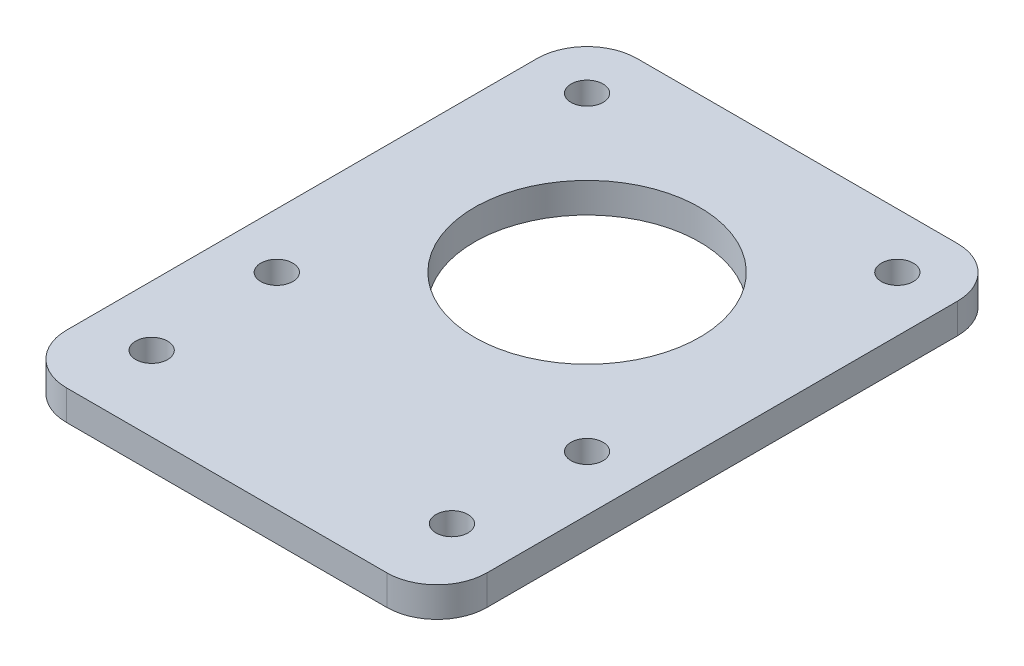
ISO-10303-21;
HEADER;
FILE_DESCRIPTION(('STEP AP214'),'2;1');
FILE_NAME('part.step','',(''),(''),'','','');
FILE_SCHEMA(('AUTOMOTIVE_DESIGN { 1 0 10303 214 1 1 1 1 }'));
ENDSEC;
DATA;
#1=APPLICATION_CONTEXT('core data for automotive mechanical design processes');
#2=APPLICATION_PROTOCOL_DEFINITION('international standard','automotive_design',2000,#1);
#3=PRODUCT_CONTEXT('',#1,'mechanical');
#4=PRODUCT('Part','Part','',(#3));
#5=PRODUCT_RELATED_PRODUCT_CATEGORY('part','',(#4));
#6=PRODUCT_DEFINITION_FORMATION('','',#4);
#7=PRODUCT_DEFINITION_CONTEXT('part definition',#1,'design');
#8=PRODUCT_DEFINITION('design','',#6,#7);
#9=PRODUCT_DEFINITION_SHAPE('','',#8);
#10=(LENGTH_UNIT() NAMED_UNIT(*) SI_UNIT(.MILLI.,.METRE.));
#11=(NAMED_UNIT(*) PLANE_ANGLE_UNIT() SI_UNIT($,.RADIAN.));
#12=(NAMED_UNIT(*) SI_UNIT($,.STERADIAN.) SOLID_ANGLE_UNIT());
#13=UNCERTAINTY_MEASURE_WITH_UNIT(LENGTH_MEASURE(1.E-05),#10,'distance_accuracy_value','');
#14=(GEOMETRIC_REPRESENTATION_CONTEXT(3) GLOBAL_UNCERTAINTY_ASSIGNED_CONTEXT((#13)) GLOBAL_UNIT_ASSIGNED_CONTEXT((#10,
#11,#12)) REPRESENTATION_CONTEXT('',''));
#15=CARTESIAN_POINT('',(0.,0.,0.));
#16=DIRECTION('',(0.,0.,1.));
#17=DIRECTION('',(1.,0.,0.));
#18=AXIS2_PLACEMENT_3D('',#15,#16,#17);
#19=CARTESIAN_POINT('',(0.,3.,0.));
#20=DIRECTION('',(0.,-1.,0.));
#21=DIRECTION('',(0.,0.,-1.));
#22=AXIS2_PLACEMENT_3D('',#19,#20,#21);
#23=PLANE('',#22);
#24=DIRECTION('',(-1.,0.,0.));
#25=VECTOR('',#24,1.);
#26=CARTESIAN_POINT('',(0.,3.,-57.));
#27=LINE('',#26,#25);
#28=CARTESIAN_POINT('',(37.,3.,-57.));
#29=VERTEX_POINT('',#28);
#30=CARTESIAN_POINT('',(5.,3.,-57.));
#31=VERTEX_POINT('',#30);
#32=EDGE_CURVE('E146',#29,#31,#27,.T.);
#33=ORIENTED_EDGE('',*,*,#32,.T.);
#34=CARTESIAN_POINT('',(5.,3.,-52.));
#35=DIRECTION('',(0.,-1.,0.));
#36=DIRECTION('',(0.,0.,-1.));
#37=AXIS2_PLACEMENT_3D('',#34,#35,#36);
#38=CIRCLE('',#37,5.);
#39=CARTESIAN_POINT('',(0.,3.,-52.));
#40=VERTEX_POINT('',#39);
#41=EDGE_CURVE('E164',#31,#40,#38,.F.);
#42=ORIENTED_EDGE('',*,*,#41,.T.);
#43=DIRECTION('',(0.,0.,1.));
#44=VECTOR('',#43,1.);
#45=CARTESIAN_POINT('',(0.,3.,0.));
#46=LINE('',#45,#44);
#47=CARTESIAN_POINT('',(0.,3.,-5.));
#48=VERTEX_POINT('',#47);
#49=EDGE_CURVE('E128',#40,#48,#46,.T.);
#50=ORIENTED_EDGE('',*,*,#49,.T.);
#51=CARTESIAN_POINT('',(5.,3.,-5.));
#52=DIRECTION('',(0.,-1.,0.));
#53=DIRECTION('',(0.,0.,-1.));
#54=AXIS2_PLACEMENT_3D('',#51,#52,#53);
#55=CIRCLE('',#54,5.);
#56=CARTESIAN_POINT('',(5.,3.,0.));
#57=VERTEX_POINT('',#56);
#58=EDGE_CURVE('E160',#48,#57,#55,.F.);
#59=ORIENTED_EDGE('',*,*,#58,.T.);
#60=DIRECTION('',(1.,0.,0.));
#61=VECTOR('',#60,1.);
#62=CARTESIAN_POINT('',(0.,3.,0.));
#63=LINE('',#62,#61);
#64=CARTESIAN_POINT('',(37.,3.,0.));
#65=VERTEX_POINT('',#64);
#66=EDGE_CURVE('E173',#57,#65,#63,.T.);
#67=ORIENTED_EDGE('',*,*,#66,.T.);
#68=CARTESIAN_POINT('',(37.,3.,-5.));
#69=DIRECTION('',(0.,-1.,0.));
#70=DIRECTION('',(0.,0.,-1.));
#71=AXIS2_PLACEMENT_3D('',#68,#69,#70);
#72=CIRCLE('',#71,5.);
#73=CARTESIAN_POINT('',(42.,3.,-5.));
#74=VERTEX_POINT('',#73);
#75=EDGE_CURVE('E63',#65,#74,#72,.F.);
#76=ORIENTED_EDGE('',*,*,#75,.T.);
#77=DIRECTION('',(0.,0.,-1.));
#78=VECTOR('',#77,1.);
#79=CARTESIAN_POINT('',(42.,3.,0.));
#80=LINE('',#79,#78);
#81=CARTESIAN_POINT('',(42.,3.,-52.));
#82=VERTEX_POINT('',#81);
#83=EDGE_CURVE('E179',#74,#82,#80,.T.);
#84=ORIENTED_EDGE('',*,*,#83,.T.);
#85=CARTESIAN_POINT('',(37.,3.,-52.));
#86=DIRECTION('',(0.,-1.,0.));
#87=DIRECTION('',(0.,0.,-1.));
#88=AXIS2_PLACEMENT_3D('',#85,#86,#87);
#89=CIRCLE('',#88,5.);
#90=EDGE_CURVE('E162',#82,#29,#89,.F.);
#91=ORIENTED_EDGE('',*,*,#90,.T.);
#92=EDGE_LOOP('',(#33,#42,#50,#59,#67,#76,#84,#91));
#93=FACE_BOUND('',#92,.T.);
#94=CARTESIAN_POINT('',(36.5,3.,-51.5));
#95=DIRECTION('',(0.,1.,0.));
#96=DIRECTION('',(0.,0.,1.));
#97=AXIS2_PLACEMENT_3D('',#94,#95,#96);
#98=CIRCLE('',#97,1.6);
#99=CARTESIAN_POINT('',(36.5,3.,-49.9));
#100=VERTEX_POINT('',#99);
#101=EDGE_CURVE('E137',#100,#100,#98,.T.);
#102=ORIENTED_EDGE('',*,*,#101,.F.);
#103=EDGE_LOOP('',(#102));
#104=FACE_BOUND('',#103,.T.);
#105=CARTESIAN_POINT('',(5.5,3.,-51.5));
#106=DIRECTION('',(0.,1.,0.));
#107=DIRECTION('',(0.,0.,1.));
#108=AXIS2_PLACEMENT_3D('',#105,#106,#107);
#109=CIRCLE('',#108,1.6);
#110=CARTESIAN_POINT('',(5.5,3.,-49.9));
#111=VERTEX_POINT('',#110);
#112=EDGE_CURVE('E194',#111,#111,#109,.T.);
#113=ORIENTED_EDGE('',*,*,#112,.F.);
#114=EDGE_LOOP('',(#113));
#115=FACE_BOUND('',#114,.T.);
#116=CARTESIAN_POINT('',(5.5,3.,-20.5));
#117=DIRECTION('',(0.,1.,0.));
#118=DIRECTION('',(0.,0.,1.));
#119=AXIS2_PLACEMENT_3D('',#116,#117,#118);
#120=CIRCLE('',#119,1.6);
#121=CARTESIAN_POINT('',(5.5,3.,-18.9));
#122=VERTEX_POINT('',#121);
#123=EDGE_CURVE('E199',#122,#122,#120,.T.);
#124=ORIENTED_EDGE('',*,*,#123,.F.);
#125=EDGE_LOOP('',(#124));
#126=FACE_BOUND('',#125,.T.);
#127=CARTESIAN_POINT('',(36.5,3.,-20.5));
#128=DIRECTION('',(0.,1.,0.));
#129=DIRECTION('',(0.,0.,1.));
#130=AXIS2_PLACEMENT_3D('',#127,#128,#129);
#131=CIRCLE('',#130,1.6);
#132=CARTESIAN_POINT('',(36.5,3.,-18.9));
#133=VERTEX_POINT('',#132);
#134=EDGE_CURVE('E205',#133,#133,#131,.T.);
#135=ORIENTED_EDGE('',*,*,#134,.F.);
#136=EDGE_LOOP('',(#135));
#137=FACE_BOUND('',#136,.T.);
#138=CARTESIAN_POINT('',(6.,3.,-7.49999999999999));
#139=DIRECTION('',(0.,1.,0.));
#140=DIRECTION('',(0.,0.,1.));
#141=AXIS2_PLACEMENT_3D('',#138,#139,#140);
#142=CIRCLE('',#141,1.6);
#143=CARTESIAN_POINT('',(6.,3.,-5.9));
#144=VERTEX_POINT('',#143);
#145=EDGE_CURVE('E211',#144,#144,#142,.T.);
#146=ORIENTED_EDGE('',*,*,#145,.F.);
#147=EDGE_LOOP('',(#146));
#148=FACE_BOUND('',#147,.T.);
#149=CARTESIAN_POINT('',(36.,3.,-7.49999999999999));
#150=DIRECTION('',(0.,1.,0.));
#151=DIRECTION('',(0.,0.,1.));
#152=AXIS2_PLACEMENT_3D('',#149,#150,#151);
#153=CIRCLE('',#152,1.6);
#154=CARTESIAN_POINT('',(36.,3.,-5.9));
#155=VERTEX_POINT('',#154);
#156=EDGE_CURVE('E217',#155,#155,#153,.T.);
#157=ORIENTED_EDGE('',*,*,#156,.F.);
#158=EDGE_LOOP('',(#157));
#159=FACE_BOUND('',#158,.T.);
#160=CARTESIAN_POINT('',(21.,3.,-36.));
#161=DIRECTION('',(0.,1.,0.));
#162=DIRECTION('',(0.,0.,1.));
#163=AXIS2_PLACEMENT_3D('',#160,#161,#162);
#164=CIRCLE('',#163,11.25);
#165=CARTESIAN_POINT('',(21.,3.,-24.75));
#166=VERTEX_POINT('',#165);
#167=EDGE_CURVE('E223',#166,#166,#164,.T.);
#168=ORIENTED_EDGE('',*,*,#167,.F.);
#169=EDGE_LOOP('',(#168));
#170=FACE_BOUND('',#169,.T.);
#171=ADVANCED_FACE('F41',(#93,#104,#115,#126,#137,#148,#159,#170),#23,.F.);
#172=CARTESIAN_POINT('',(0.,0.,0.));
#173=DIRECTION('',(0.,-1.,0.));
#174=DIRECTION('',(0.,0.,-1.));
#175=AXIS2_PLACEMENT_3D('',#172,#173,#174);
#176=PLANE('',#175);
#177=CARTESIAN_POINT('',(36.,0.,-7.49999999999999));
#178=DIRECTION('',(0.,1.,0.));
#179=DIRECTION('',(0.,0.,1.));
#180=AXIS2_PLACEMENT_3D('',#177,#178,#179);
#181=CIRCLE('',#180,1.6);
#182=CARTESIAN_POINT('',(36.,0.,-5.9));
#183=VERTEX_POINT('',#182);
#184=EDGE_CURVE('E220',#183,#183,#181,.T.);
#185=ORIENTED_EDGE('',*,*,#184,.T.);
#186=EDGE_LOOP('',(#185));
#187=FACE_BOUND('',#186,.T.);
#188=CARTESIAN_POINT('',(36.5,0.,-20.5));
#189=DIRECTION('',(0.,1.,0.));
#190=DIRECTION('',(0.,0.,1.));
#191=AXIS2_PLACEMENT_3D('',#188,#189,#190);
#192=CIRCLE('',#191,1.6);
#193=CARTESIAN_POINT('',(36.5,0.,-18.9));
#194=VERTEX_POINT('',#193);
#195=EDGE_CURVE('E208',#194,#194,#192,.T.);
#196=ORIENTED_EDGE('',*,*,#195,.T.);
#197=EDGE_LOOP('',(#196));
#198=FACE_BOUND('',#197,.T.);
#199=CARTESIAN_POINT('',(5.5,0.,-51.5));
#200=DIRECTION('',(0.,1.,0.));
#201=DIRECTION('',(0.,0.,1.));
#202=AXIS2_PLACEMENT_3D('',#199,#200,#201);
#203=CIRCLE('',#202,1.6);
#204=CARTESIAN_POINT('',(5.5,0.,-49.9));
#205=VERTEX_POINT('',#204);
#206=EDGE_CURVE('E196',#205,#205,#203,.T.);
#207=ORIENTED_EDGE('',*,*,#206,.T.);
#208=EDGE_LOOP('',(#207));
#209=FACE_BOUND('',#208,.T.);
#210=DIRECTION('',(0.,0.,1.));
#211=VECTOR('',#210,1.);
#212=CARTESIAN_POINT('',(0.,0.,0.));
#213=LINE('',#212,#211);
#214=CARTESIAN_POINT('',(0.,0.,-52.));
#215=VERTEX_POINT('',#214);
#216=CARTESIAN_POINT('',(0.,0.,-5.));
#217=VERTEX_POINT('',#216);
#218=EDGE_CURVE('E125',#215,#217,#213,.T.);
#219=ORIENTED_EDGE('',*,*,#218,.F.);
#220=CARTESIAN_POINT('',(5.,0.,-52.));
#221=DIRECTION('',(0.,-1.,0.));
#222=DIRECTION('',(0.,0.,-1.));
#223=AXIS2_PLACEMENT_3D('',#220,#221,#222);
#224=CIRCLE('',#223,5.);
#225=CARTESIAN_POINT('',(5.,0.,-57.));
#226=VERTEX_POINT('',#225);
#227=EDGE_CURVE('E108',#215,#226,#224,.T.);
#228=ORIENTED_EDGE('',*,*,#227,.T.);
#229=DIRECTION('',(-1.,0.,0.));
#230=VECTOR('',#229,1.);
#231=CARTESIAN_POINT('',(0.,0.,-57.));
#232=LINE('',#231,#230);
#233=CARTESIAN_POINT('',(37.,0.,-57.));
#234=VERTEX_POINT('',#233);
#235=EDGE_CURVE('E150',#234,#226,#232,.T.);
#236=ORIENTED_EDGE('',*,*,#235,.F.);
#237=CARTESIAN_POINT('',(37.,0.,-52.));
#238=DIRECTION('',(0.,-1.,0.));
#239=DIRECTION('',(0.,0.,-1.));
#240=AXIS2_PLACEMENT_3D('',#237,#238,#239);
#241=CIRCLE('',#240,5.);
#242=CARTESIAN_POINT('',(42.,0.,-52.));
#243=VERTEX_POINT('',#242);
#244=EDGE_CURVE('E119',#234,#243,#241,.T.);
#245=ORIENTED_EDGE('',*,*,#244,.T.);
#246=DIRECTION('',(0.,0.,-1.));
#247=VECTOR('',#246,1.);
#248=CARTESIAN_POINT('',(42.,0.,0.));
#249=LINE('',#248,#247);
#250=CARTESIAN_POINT('',(42.,0.,-5.));
#251=VERTEX_POINT('',#250);
#252=EDGE_CURVE('E140',#251,#243,#249,.T.);
#253=ORIENTED_EDGE('',*,*,#252,.F.);
#254=CARTESIAN_POINT('',(37.,0.,-5.));
#255=DIRECTION('',(0.,-1.,0.));
#256=DIRECTION('',(0.,0.,-1.));
#257=AXIS2_PLACEMENT_3D('',#254,#255,#256);
#258=CIRCLE('',#257,5.);
#259=CARTESIAN_POINT('',(37.,0.,0.));
#260=VERTEX_POINT('',#259);
#261=EDGE_CURVE('E129',#251,#260,#258,.T.);
#262=ORIENTED_EDGE('',*,*,#261,.T.);
#263=DIRECTION('',(1.,0.,0.));
#264=VECTOR('',#263,1.);
#265=CARTESIAN_POINT('',(0.,0.,0.));
#266=LINE('',#265,#264);
#267=CARTESIAN_POINT('',(5.,0.,0.));
#268=VERTEX_POINT('',#267);
#269=EDGE_CURVE('E136',#268,#260,#266,.T.);
#270=ORIENTED_EDGE('',*,*,#269,.F.);
#271=CARTESIAN_POINT('',(5.,0.,-5.));
#272=DIRECTION('',(0.,-1.,0.));
#273=DIRECTION('',(0.,0.,-1.));
#274=AXIS2_PLACEMENT_3D('',#271,#272,#273);
#275=CIRCLE('',#274,5.);
#276=EDGE_CURVE('E135',#268,#217,#275,.T.);
#277=ORIENTED_EDGE('',*,*,#276,.T.);
#278=EDGE_LOOP('',(#219,#228,#236,#245,#253,#262,#270,#277));
#279=FACE_BOUND('',#278,.T.);
#280=CARTESIAN_POINT('',(36.5,0.,-51.5));
#281=DIRECTION('',(0.,1.,0.));
#282=DIRECTION('',(0.,0.,1.));
#283=AXIS2_PLACEMENT_3D('',#280,#281,#282);
#284=CIRCLE('',#283,1.6);
#285=CARTESIAN_POINT('',(36.5,0.,-49.9));
#286=VERTEX_POINT('',#285);
#287=EDGE_CURVE('E143',#286,#286,#284,.T.);
#288=ORIENTED_EDGE('',*,*,#287,.T.);
#289=EDGE_LOOP('',(#288));
#290=FACE_BOUND('',#289,.T.);
#291=CARTESIAN_POINT('',(5.5,0.,-20.5));
#292=DIRECTION('',(0.,1.,0.));
#293=DIRECTION('',(0.,0.,1.));
#294=AXIS2_PLACEMENT_3D('',#291,#292,#293);
#295=CIRCLE('',#294,1.6);
#296=CARTESIAN_POINT('',(5.5,0.,-18.9));
#297=VERTEX_POINT('',#296);
#298=EDGE_CURVE('E202',#297,#297,#295,.T.);
#299=ORIENTED_EDGE('',*,*,#298,.T.);
#300=EDGE_LOOP('',(#299));
#301=FACE_BOUND('',#300,.T.);
#302=CARTESIAN_POINT('',(6.,0.,-7.49999999999999));
#303=DIRECTION('',(0.,1.,0.));
#304=DIRECTION('',(0.,0.,1.));
#305=AXIS2_PLACEMENT_3D('',#302,#303,#304);
#306=CIRCLE('',#305,1.6);
#307=CARTESIAN_POINT('',(6.,0.,-5.9));
#308=VERTEX_POINT('',#307);
#309=EDGE_CURVE('E214',#308,#308,#306,.T.);
#310=ORIENTED_EDGE('',*,*,#309,.T.);
#311=EDGE_LOOP('',(#310));
#312=FACE_BOUND('',#311,.T.);
#313=CARTESIAN_POINT('',(21.,0.,-36.));
#314=DIRECTION('',(0.,1.,0.));
#315=DIRECTION('',(0.,0.,1.));
#316=AXIS2_PLACEMENT_3D('',#313,#314,#315);
#317=CIRCLE('',#316,11.25);
#318=CARTESIAN_POINT('',(21.,0.,-24.75));
#319=VERTEX_POINT('',#318);
#320=EDGE_CURVE('E226',#319,#319,#317,.T.);
#321=ORIENTED_EDGE('',*,*,#320,.T.);
#322=EDGE_LOOP('',(#321));
#323=FACE_BOUND('',#322,.T.);
#324=ADVANCED_FACE('F132',(#187,#198,#209,#279,#290,#301,#312,#323),#176,.T.);
#325=CARTESIAN_POINT('',(0.,3.,0.));
#326=DIRECTION('',(1.,0.,0.));
#327=DIRECTION('',(0.,0.,-1.));
#328=AXIS2_PLACEMENT_3D('',#325,#326,#327);
#329=PLANE('',#328);
#330=ORIENTED_EDGE('',*,*,#49,.F.);
#331=DIRECTION('',(0.,-1.,0.));
#332=VECTOR('',#331,1.);
#333=CARTESIAN_POINT('',(0.,3.,-52.));
#334=LINE('',#333,#332);
#335=EDGE_CURVE('E112',#40,#215,#334,.T.);
#336=ORIENTED_EDGE('',*,*,#335,.T.);
#337=ORIENTED_EDGE('',*,*,#218,.T.);
#338=DIRECTION('',(0.,-1.,0.));
#339=VECTOR('',#338,1.);
#340=CARTESIAN_POINT('',(0.,3.,-5.));
#341=LINE('',#340,#339);
#342=EDGE_CURVE('E130',#217,#48,#341,.F.);
#343=ORIENTED_EDGE('',*,*,#342,.T.);
#344=EDGE_LOOP('',(#330,#336,#337,#343));
#345=FACE_BOUND('',#344,.T.);
#346=ADVANCED_FACE('F124',(#345),#329,.F.);
#347=CARTESIAN_POINT('',(0.,3.,0.));
#348=DIRECTION('',(0.,0.,-1.));
#349=DIRECTION('',(-1.,0.,0.));
#350=AXIS2_PLACEMENT_3D('',#347,#348,#349);
#351=PLANE('',#350);
#352=ORIENTED_EDGE('',*,*,#66,.F.);
#353=DIRECTION('',(0.,-1.,0.));
#354=VECTOR('',#353,1.);
#355=CARTESIAN_POINT('',(5.,3.,0.));
#356=LINE('',#355,#354);
#357=EDGE_CURVE('E11',#57,#268,#356,.T.);
#358=ORIENTED_EDGE('',*,*,#357,.T.);
#359=ORIENTED_EDGE('',*,*,#269,.T.);
#360=DIRECTION('',(0.,-1.,0.));
#361=VECTOR('',#360,1.);
#362=CARTESIAN_POINT('',(37.,3.,0.));
#363=LINE('',#362,#361);
#364=EDGE_CURVE('E49',#260,#65,#363,.F.);
#365=ORIENTED_EDGE('',*,*,#364,.T.);
#366=EDGE_LOOP('',(#352,#358,#359,#365));
#367=FACE_BOUND('',#366,.T.);
#368=ADVANCED_FACE('F172',(#367),#351,.F.);
#369=CARTESIAN_POINT('',(42.,3.,0.));
#370=DIRECTION('',(-1.,0.,0.));
#371=DIRECTION('',(0.,0.,1.));
#372=AXIS2_PLACEMENT_3D('',#369,#370,#371);
#373=PLANE('',#372);
#374=ORIENTED_EDGE('',*,*,#252,.T.);
#375=DIRECTION('',(0.,-1.,0.));
#376=VECTOR('',#375,1.);
#377=CARTESIAN_POINT('',(42.,3.,-52.));
#378=LINE('',#377,#376);
#379=EDGE_CURVE('E56',#243,#82,#378,.F.);
#380=ORIENTED_EDGE('',*,*,#379,.T.);
#381=ORIENTED_EDGE('',*,*,#83,.F.);
#382=DIRECTION('',(0.,-1.,0.));
#383=VECTOR('',#382,1.);
#384=CARTESIAN_POINT('',(42.,3.,-5.));
#385=LINE('',#384,#383);
#386=EDGE_CURVE('E166',#74,#251,#385,.T.);
#387=ORIENTED_EDGE('',*,*,#386,.T.);
#388=EDGE_LOOP('',(#374,#380,#381,#387));
#389=FACE_BOUND('',#388,.T.);
#390=ADVANCED_FACE('F183',(#389),#373,.F.);
#391=CARTESIAN_POINT('',(0.,3.,-57.));
#392=DIRECTION('',(0.,0.,1.));
#393=DIRECTION('',(1.,0.,0.));
#394=AXIS2_PLACEMENT_3D('',#391,#392,#393);
#395=PLANE('',#394);
#396=ORIENTED_EDGE('',*,*,#235,.T.);
#397=DIRECTION('',(0.,-1.,0.));
#398=VECTOR('',#397,1.);
#399=CARTESIAN_POINT('',(5.,3.,-57.));
#400=LINE('',#399,#398);
#401=EDGE_CURVE('E113',#226,#31,#400,.F.);
#402=ORIENTED_EDGE('',*,*,#401,.T.);
#403=ORIENTED_EDGE('',*,*,#32,.F.);
#404=DIRECTION('',(0.,-1.,0.));
#405=VECTOR('',#404,1.);
#406=CARTESIAN_POINT('',(37.,3.,-57.));
#407=LINE('',#406,#405);
#408=EDGE_CURVE('E118',#29,#234,#407,.T.);
#409=ORIENTED_EDGE('',*,*,#408,.T.);
#410=EDGE_LOOP('',(#396,#402,#403,#409));
#411=FACE_BOUND('',#410,.T.);
#412=ADVANCED_FACE('F190',(#411),#395,.F.);
#413=CARTESIAN_POINT('',(36.5,3.,-51.5));
#414=DIRECTION('',(0.,-1.,0.));
#415=DIRECTION('',(0.,0.,-1.));
#416=AXIS2_PLACEMENT_3D('',#413,#414,#415);
#417=CYLINDRICAL_SURFACE('',#416,1.6);
#418=ORIENTED_EDGE('',*,*,#101,.T.);
#419=EDGE_LOOP('',(#418));
#420=FACE_BOUND('',#419,.T.);
#421=ORIENTED_EDGE('',*,*,#287,.F.);
#422=EDGE_LOOP('',(#421));
#423=FACE_BOUND('',#422,.T.);
#424=ADVANCED_FACE('F244',(#420,#423),#417,.F.);
#425=CARTESIAN_POINT('',(5.5,3.,-51.5));
#426=DIRECTION('',(0.,-1.,0.));
#427=DIRECTION('',(0.,0.,-1.));
#428=AXIS2_PLACEMENT_3D('',#425,#426,#427);
#429=CYLINDRICAL_SURFACE('',#428,1.6);
#430=ORIENTED_EDGE('',*,*,#112,.T.);
#431=EDGE_LOOP('',(#430));
#432=FACE_BOUND('',#431,.T.);
#433=ORIENTED_EDGE('',*,*,#206,.F.);
#434=EDGE_LOOP('',(#433));
#435=FACE_BOUND('',#434,.T.);
#436=ADVANCED_FACE('F330',(#432,#435),#429,.F.);
#437=CARTESIAN_POINT('',(5.5,3.,-20.5));
#438=DIRECTION('',(0.,-1.,0.));
#439=DIRECTION('',(0.,0.,-1.));
#440=AXIS2_PLACEMENT_3D('',#437,#438,#439);
#441=CYLINDRICAL_SURFACE('',#440,1.6);
#442=ORIENTED_EDGE('',*,*,#123,.T.);
#443=EDGE_LOOP('',(#442));
#444=FACE_BOUND('',#443,.T.);
#445=ORIENTED_EDGE('',*,*,#298,.F.);
#446=EDGE_LOOP('',(#445));
#447=FACE_BOUND('',#446,.T.);
#448=ADVANCED_FACE('F320',(#444,#447),#441,.F.);
#449=CARTESIAN_POINT('',(36.5,3.,-20.5));
#450=DIRECTION('',(0.,-1.,0.));
#451=DIRECTION('',(0.,0.,-1.));
#452=AXIS2_PLACEMENT_3D('',#449,#450,#451);
#453=CYLINDRICAL_SURFACE('',#452,1.6);
#454=ORIENTED_EDGE('',*,*,#134,.T.);
#455=EDGE_LOOP('',(#454));
#456=FACE_BOUND('',#455,.T.);
#457=ORIENTED_EDGE('',*,*,#195,.F.);
#458=EDGE_LOOP('',(#457));
#459=FACE_BOUND('',#458,.T.);
#460=ADVANCED_FACE('F310',(#456,#459),#453,.F.);
#461=CARTESIAN_POINT('',(6.,3.,-7.49999999999999));
#462=DIRECTION('',(0.,-1.,0.));
#463=DIRECTION('',(0.,0.,-1.));
#464=AXIS2_PLACEMENT_3D('',#461,#462,#463);
#465=CYLINDRICAL_SURFACE('',#464,1.6);
#466=ORIENTED_EDGE('',*,*,#145,.T.);
#467=EDGE_LOOP('',(#466));
#468=FACE_BOUND('',#467,.T.);
#469=ORIENTED_EDGE('',*,*,#309,.F.);
#470=EDGE_LOOP('',(#469));
#471=FACE_BOUND('',#470,.T.);
#472=ADVANCED_FACE('F300',(#468,#471),#465,.F.);
#473=CARTESIAN_POINT('',(36.,3.,-7.49999999999999));
#474=DIRECTION('',(0.,-1.,0.));
#475=DIRECTION('',(0.,0.,-1.));
#476=AXIS2_PLACEMENT_3D('',#473,#474,#475);
#477=CYLINDRICAL_SURFACE('',#476,1.6);
#478=ORIENTED_EDGE('',*,*,#156,.T.);
#479=EDGE_LOOP('',(#478));
#480=FACE_BOUND('',#479,.T.);
#481=ORIENTED_EDGE('',*,*,#184,.F.);
#482=EDGE_LOOP('',(#481));
#483=FACE_BOUND('',#482,.T.);
#484=ADVANCED_FACE('F291',(#480,#483),#477,.F.);
#485=CARTESIAN_POINT('',(21.,3.,-36.));
#486=DIRECTION('',(0.,-1.,0.));
#487=DIRECTION('',(0.,0.,-1.));
#488=AXIS2_PLACEMENT_3D('',#485,#486,#487);
#489=CYLINDRICAL_SURFACE('',#488,11.25);
#490=ORIENTED_EDGE('',*,*,#167,.T.);
#491=EDGE_LOOP('',(#490));
#492=FACE_BOUND('',#491,.T.);
#493=ORIENTED_EDGE('',*,*,#320,.F.);
#494=EDGE_LOOP('',(#493));
#495=FACE_BOUND('',#494,.T.);
#496=ADVANCED_FACE('F232',(#492,#495),#489,.F.);
#497=CARTESIAN_POINT('',(5.,3.,-52.));
#498=DIRECTION('',(0.,-1.,0.));
#499=DIRECTION('',(0.,0.,-1.));
#500=AXIS2_PLACEMENT_3D('',#497,#498,#499);
#501=CYLINDRICAL_SURFACE('',#500,5.);
#502=ORIENTED_EDGE('',*,*,#41,.F.);
#503=ORIENTED_EDGE('',*,*,#401,.F.);
#504=ORIENTED_EDGE('',*,*,#227,.F.);
#505=ORIENTED_EDGE('',*,*,#335,.F.);
#506=EDGE_LOOP('',(#502,#503,#504,#505));
#507=FACE_BOUND('',#506,.T.);
#508=ADVANCED_FACE('F111',(#507),#501,.T.);
#509=CARTESIAN_POINT('',(37.,3.,-52.));
#510=DIRECTION('',(0.,-1.,0.));
#511=DIRECTION('',(0.,0.,-1.));
#512=AXIS2_PLACEMENT_3D('',#509,#510,#511);
#513=CYLINDRICAL_SURFACE('',#512,5.);
#514=ORIENTED_EDGE('',*,*,#90,.F.);
#515=ORIENTED_EDGE('',*,*,#379,.F.);
#516=ORIENTED_EDGE('',*,*,#244,.F.);
#517=ORIENTED_EDGE('',*,*,#408,.F.);
#518=EDGE_LOOP('',(#514,#515,#516,#517));
#519=FACE_BOUND('',#518,.T.);
#520=ADVANCED_FACE('F187',(#519),#513,.T.);
#521=CARTESIAN_POINT('',(5.,3.,-5.));
#522=DIRECTION('',(0.,-1.,0.));
#523=DIRECTION('',(0.,0.,-1.));
#524=AXIS2_PLACEMENT_3D('',#521,#522,#523);
#525=CYLINDRICAL_SURFACE('',#524,5.);
#526=ORIENTED_EDGE('',*,*,#58,.F.);
#527=ORIENTED_EDGE('',*,*,#342,.F.);
#528=ORIENTED_EDGE('',*,*,#276,.F.);
#529=ORIENTED_EDGE('',*,*,#357,.F.);
#530=EDGE_LOOP('',(#526,#527,#528,#529));
#531=FACE_BOUND('',#530,.T.);
#532=ADVANCED_FACE('F258',(#531),#525,.T.);
#533=CARTESIAN_POINT('',(37.,3.,-5.));
#534=DIRECTION('',(0.,-1.,0.));
#535=DIRECTION('',(0.,0.,-1.));
#536=AXIS2_PLACEMENT_3D('',#533,#534,#535);
#537=CYLINDRICAL_SURFACE('',#536,5.);
#538=ORIENTED_EDGE('',*,*,#75,.F.);
#539=ORIENTED_EDGE('',*,*,#364,.F.);
#540=ORIENTED_EDGE('',*,*,#261,.F.);
#541=ORIENTED_EDGE('',*,*,#386,.F.);
#542=EDGE_LOOP('',(#538,#539,#540,#541));
#543=FACE_BOUND('',#542,.T.);
#544=ADVANCED_FACE('F43',(#543),#537,.T.);
#545=CLOSED_SHELL('',(#171,#324,#346,#368,#390,#412,#424,#436,#448,#460,#472,#484,#496,#508,
#520,#532,#544));
#546=MANIFOLD_SOLID_BREP('B2',#545);
#547=ADVANCED_BREP_SHAPE_REPRESENTATION('',(#18,#546),#14);
#548=SHAPE_DEFINITION_REPRESENTATION(#9,#547);
ENDSEC;
END-ISO-10303-21;
